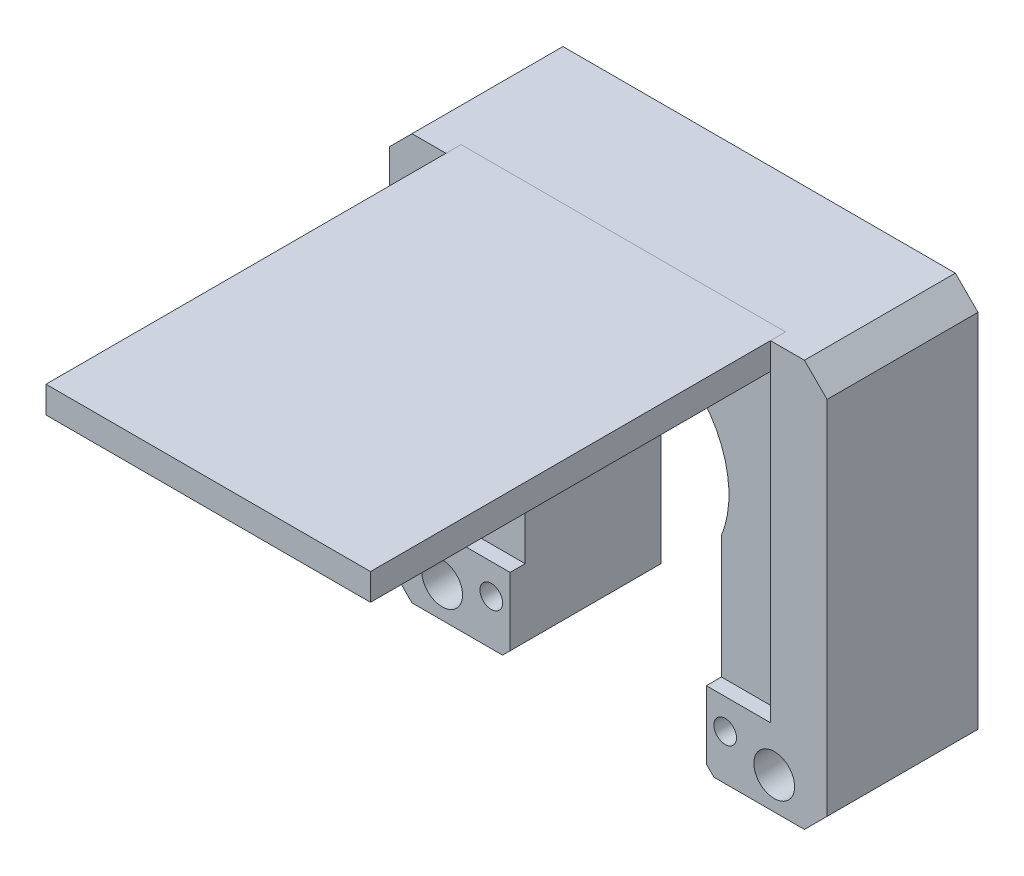
ISO-10303-21;
HEADER;
FILE_DESCRIPTION(('STEP AP214'),'2;1');
FILE_NAME('part.step','',(''),(''),'','','');
FILE_SCHEMA(('AUTOMOTIVE_DESIGN { 1 0 10303 214 1 1 1 1 }'));
ENDSEC;
DATA;
#1=APPLICATION_CONTEXT('core data for automotive mechanical design processes');
#2=APPLICATION_PROTOCOL_DEFINITION('international standard','automotive_design',2000,#1);
#3=PRODUCT_CONTEXT('',#1,'mechanical');
#4=PRODUCT('Part','Part','',(#3));
#5=PRODUCT_RELATED_PRODUCT_CATEGORY('part','',(#4));
#6=PRODUCT_DEFINITION_FORMATION('','',#4);
#7=PRODUCT_DEFINITION_CONTEXT('part definition',#1,'design');
#8=PRODUCT_DEFINITION('design','',#6,#7);
#9=PRODUCT_DEFINITION_SHAPE('','',#8);
#10=(LENGTH_UNIT() NAMED_UNIT(*) SI_UNIT(.MILLI.,.METRE.));
#11=(NAMED_UNIT(*) PLANE_ANGLE_UNIT() SI_UNIT($,.RADIAN.));
#12=(NAMED_UNIT(*) SI_UNIT($,.STERADIAN.) SOLID_ANGLE_UNIT());
#13=UNCERTAINTY_MEASURE_WITH_UNIT(LENGTH_MEASURE(1.E-05),#10,'distance_accuracy_value','');
#14=(GEOMETRIC_REPRESENTATION_CONTEXT(3) GLOBAL_UNCERTAINTY_ASSIGNED_CONTEXT((#13)) GLOBAL_UNIT_ASSIGNED_CONTEXT((#10,
#11,#12)) REPRESENTATION_CONTEXT('',''));
#15=CARTESIAN_POINT('',(0.,0.,0.));
#16=DIRECTION('',(0.,0.,1.));
#17=DIRECTION('',(1.,0.,0.));
#18=AXIS2_PLACEMENT_3D('',#15,#16,#17);
#19=CARTESIAN_POINT('',(-21.5,10.,73.));
#20=DIRECTION('',(1.,0.,0.));
#21=DIRECTION('',(0.,0.,-1.));
#22=AXIS2_PLACEMENT_3D('',#19,#20,#21);
#23=PLANE('',#22);
#24=DIRECTION('',(0.,-1.,0.));
#25=VECTOR('',#24,1.);
#26=CARTESIAN_POINT('',(-21.5,10.,18.));
#27=LINE('',#26,#25);
#28=CARTESIAN_POINT('',(-21.5,10.,18.));
#29=VERTEX_POINT('',#28);
#30=CARTESIAN_POINT('',(-21.5,6.46596793747799,18.));
#31=VERTEX_POINT('',#30);
#32=EDGE_CURVE('E114',#29,#31,#27,.T.);
#33=ORIENTED_EDGE('',*,*,#32,.T.);
#34=DIRECTION('',(0.,0.,-1.));
#35=VECTOR('',#34,1.);
#36=CARTESIAN_POINT('',(-21.5,6.46596793747799,73.));
#37=LINE('',#36,#35);
#38=CARTESIAN_POINT('',(-21.5,6.46596793747799,73.));
#39=VERTEX_POINT('',#38);
#40=EDGE_CURVE('E12',#39,#31,#37,.T.);
#41=ORIENTED_EDGE('',*,*,#40,.F.);
#42=DIRECTION('',(0.,-1.,0.));
#43=VECTOR('',#42,1.);
#44=CARTESIAN_POINT('',(-21.5,10.,73.));
#45=LINE('',#44,#43);
#46=CARTESIAN_POINT('',(-21.5,10.,73.));
#47=VERTEX_POINT('',#46);
#48=EDGE_CURVE('E102',#47,#39,#45,.T.);
#49=ORIENTED_EDGE('',*,*,#48,.F.);
#50=DIRECTION('',(0.,0.,-1.));
#51=VECTOR('',#50,1.);
#52=CARTESIAN_POINT('',(-21.5,10.,73.));
#53=LINE('',#52,#51);
#54=EDGE_CURVE('E110',#47,#29,#53,.T.);
#55=ORIENTED_EDGE('',*,*,#54,.T.);
#56=EDGE_LOOP('',(#33,#41,#49,#55));
#57=FACE_BOUND('',#56,.T.);
#58=ADVANCED_FACE('F51',(#57),#23,.F.);
#59=CARTESIAN_POINT('',(-21.5,6.46596793747799,73.));
#60=DIRECTION('',(0.,1.,0.));
#61=DIRECTION('',(0.,0.,1.));
#62=AXIS2_PLACEMENT_3D('',#59,#60,#61);
#63=PLANE('',#62);
#64=DIRECTION('',(1.,0.,0.));
#65=VECTOR('',#64,1.);
#66=CARTESIAN_POINT('',(-21.5,6.46596793747799,18.));
#67=LINE('',#66,#65);
#68=CARTESIAN_POINT('',(21.5,6.46596793747799,18.));
#69=VERTEX_POINT('',#68);
#70=EDGE_CURVE('E106',#31,#69,#67,.T.);
#71=ORIENTED_EDGE('',*,*,#70,.T.);
#72=DIRECTION('',(0.,0.,-1.));
#73=VECTOR('',#72,1.);
#74=CARTESIAN_POINT('',(21.5,6.46596793747799,73.));
#75=LINE('',#74,#73);
#76=CARTESIAN_POINT('',(21.5,6.46596793747799,73.));
#77=VERTEX_POINT('',#76);
#78=EDGE_CURVE('E59',#77,#69,#75,.T.);
#79=ORIENTED_EDGE('',*,*,#78,.F.);
#80=DIRECTION('',(1.,0.,0.));
#81=VECTOR('',#80,1.);
#82=CARTESIAN_POINT('',(-21.5,6.46596793747799,73.));
#83=LINE('',#82,#81);
#84=EDGE_CURVE('E97',#39,#77,#83,.T.);
#85=ORIENTED_EDGE('',*,*,#84,.F.);
#86=ORIENTED_EDGE('',*,*,#40,.T.);
#87=EDGE_LOOP('',(#71,#79,#85,#86));
#88=FACE_BOUND('',#87,.T.);
#89=ADVANCED_FACE('F105',(#88),#63,.F.);
#90=CARTESIAN_POINT('',(21.5,6.46596793747799,73.));
#91=DIRECTION('',(-1.,0.,0.));
#92=DIRECTION('',(0.,-1.,0.));
#93=AXIS2_PLACEMENT_3D('',#90,#91,#92);
#94=PLANE('',#93);
#95=DIRECTION('',(0.,1.,0.));
#96=VECTOR('',#95,1.);
#97=CARTESIAN_POINT('',(21.5,6.46596793747799,18.));
#98=LINE('',#97,#96);
#99=CARTESIAN_POINT('',(21.5,10.,18.));
#100=VERTEX_POINT('',#99);
#101=EDGE_CURVE('E84',#69,#100,#98,.T.);
#102=ORIENTED_EDGE('',*,*,#101,.T.);
#103=DIRECTION('',(0.,0.,-1.));
#104=VECTOR('',#103,1.);
#105=CARTESIAN_POINT('',(21.5,10.,73.));
#106=LINE('',#105,#104);
#107=CARTESIAN_POINT('',(21.5,10.,73.));
#108=VERTEX_POINT('',#107);
#109=EDGE_CURVE('E107',#108,#100,#106,.T.);
#110=ORIENTED_EDGE('',*,*,#109,.F.);
#111=DIRECTION('',(0.,1.,0.));
#112=VECTOR('',#111,1.);
#113=CARTESIAN_POINT('',(21.5,6.46596793747799,73.));
#114=LINE('',#113,#112);
#115=EDGE_CURVE('E100',#77,#108,#114,.T.);
#116=ORIENTED_EDGE('',*,*,#115,.F.);
#117=ORIENTED_EDGE('',*,*,#78,.T.);
#118=EDGE_LOOP('',(#102,#110,#116,#117));
#119=FACE_BOUND('',#118,.T.);
#120=ADVANCED_FACE('F108',(#119),#94,.F.);
#121=CARTESIAN_POINT('',(-21.5,10.,73.));
#122=DIRECTION('',(0.,-1.,0.));
#123=DIRECTION('',(1.,0.,0.));
#124=AXIS2_PLACEMENT_3D('',#121,#122,#123);
#125=PLANE('',#124);
#126=DIRECTION('',(-1.,0.,0.));
#127=VECTOR('',#126,1.);
#128=CARTESIAN_POINT('',(-21.5,10.,18.));
#129=LINE('',#128,#127);
#130=EDGE_CURVE('E90',#100,#29,#129,.T.);
#131=ORIENTED_EDGE('',*,*,#130,.T.);
#132=ORIENTED_EDGE('',*,*,#54,.F.);
#133=DIRECTION('',(-1.,0.,0.));
#134=VECTOR('',#133,1.);
#135=CARTESIAN_POINT('',(-21.5,10.,73.));
#136=LINE('',#135,#134);
#137=EDGE_CURVE('E67',#108,#47,#136,.T.);
#138=ORIENTED_EDGE('',*,*,#137,.F.);
#139=ORIENTED_EDGE('',*,*,#109,.T.);
#140=EDGE_LOOP('',(#131,#132,#138,#139));
#141=FACE_BOUND('',#140,.T.);
#142=ADVANCED_FACE('F121',(#141),#125,.F.);
#143=CARTESIAN_POINT('',(0.,0.,73.));
#144=DIRECTION('',(0.,0.,1.));
#145=DIRECTION('',(1.,0.,0.));
#146=AXIS2_PLACEMENT_3D('',#143,#144,#145);
#147=PLANE('',#146);
#148=ORIENTED_EDGE('',*,*,#48,.T.);
#149=ORIENTED_EDGE('',*,*,#84,.T.);
#150=ORIENTED_EDGE('',*,*,#115,.T.);
#151=ORIENTED_EDGE('',*,*,#137,.T.);
#152=EDGE_LOOP('',(#148,#149,#150,#151));
#153=FACE_BOUND('',#152,.T.);
#154=ADVANCED_FACE('F98',(#153),#147,.T.);
#155=CARTESIAN_POINT('',(0.,0.,18.));
#156=DIRECTION('',(0.,0.,1.));
#157=DIRECTION('',(1.,0.,0.));
#158=AXIS2_PLACEMENT_3D('',#155,#156,#157);
#159=PLANE('',#158);
#160=ORIENTED_EDGE('',*,*,#32,.F.);
#161=ORIENTED_EDGE('',*,*,#130,.F.);
#162=ORIENTED_EDGE('',*,*,#101,.F.);
#163=ORIENTED_EDGE('',*,*,#70,.F.);
#164=EDGE_LOOP('',(#160,#161,#162,#163));
#165=FACE_BOUND('',#164,.T.);
#166=ADVANCED_FACE('F124',(#165),#159,.F.);
#167=CLOSED_SHELL('',(#58,#89,#120,#142,#154,#166));
#168=MANIFOLD_SOLID_BREP('B2',#167);
#169=CARTESIAN_POINT('',(0.,0.,20.));
#170=DIRECTION('',(0.,0.,1.));
#171=DIRECTION('',(1.,0.,0.));
#172=AXIS2_PLACEMENT_3D('',#169,#170,#171);
#173=PLANE('',#172);
#174=CARTESIAN_POINT('',(15.5,-37.84770830376,20.));
#175=DIRECTION('',(0.,0.,1.));
#176=DIRECTION('',(-1.,0.,0.));
#177=AXIS2_PLACEMENT_3D('',#174,#175,#176);
#178=CIRCLE('',#177,1.5);
#179=CARTESIAN_POINT('',(14.,-37.84770830376,20.));
#180=VERTEX_POINT('',#179);
#181=EDGE_CURVE('E673',#180,#180,#178,.T.);
#182=ORIENTED_EDGE('',*,*,#181,.F.);
#183=EDGE_LOOP('',(#182));
#184=FACE_BOUND('',#183,.T.);
#185=DIRECTION('',(0.,1.,0.));
#186=VECTOR('',#185,1.);
#187=CARTESIAN_POINT('',(13.,-69.9992877658143,20.));
#188=LINE('',#187,#186);
#189=CARTESIAN_POINT('',(13.,-42.84770830376,20.));
#190=VERTEX_POINT('',#189);
#191=CARTESIAN_POINT('',(13.,-33.84770830376,20.));
#192=VERTEX_POINT('',#191);
#193=EDGE_CURVE('E354',#190,#192,#188,.T.);
#194=ORIENTED_EDGE('',*,*,#193,.F.);
#195=DIRECTION('',(-0.707106781186551,0.707106781186544,0.));
#196=VECTOR('',#195,1.);
#197=CARTESIAN_POINT('',(-14.9238541518801,-14.9238541518802,20.));
#198=LINE('',#197,#196);
#199=CARTESIAN_POINT('',(14.,-43.84770830376,20.));
#200=VERTEX_POINT('',#199);
#201=EDGE_CURVE('E185',#190,#200,#198,.F.);
#202=ORIENTED_EDGE('',*,*,#201,.T.);
#203=DIRECTION('',(1.,0.,0.));
#204=VECTOR('',#203,1.);
#205=CARTESIAN_POINT('',(-29.,-43.84770830376,20.));
#206=LINE('',#205,#204);
#207=CARTESIAN_POINT('',(26.,-43.84770830376,20.));
#208=VERTEX_POINT('',#207);
#209=EDGE_CURVE('E457',#200,#208,#206,.T.);
#210=ORIENTED_EDGE('',*,*,#209,.T.);
#211=DIRECTION('',(-0.707106781186549,-0.707106781186546,0.));
#212=VECTOR('',#211,1.);
#213=CARTESIAN_POINT('',(34.92385415188,-34.9238541518801,20.));
#214=LINE('',#213,#212);
#215=CARTESIAN_POINT('',(29.,-40.8477083037601,20.));
#216=VERTEX_POINT('',#215);
#217=EDGE_CURVE('E543',#208,#216,#214,.F.);
#218=ORIENTED_EDGE('',*,*,#217,.T.);
#219=DIRECTION('',(0.,1.,0.));
#220=VECTOR('',#219,1.);
#221=CARTESIAN_POINT('',(29.,0.,20.));
#222=LINE('',#221,#220);
#223=CARTESIAN_POINT('',(29.,7.00000000000001,20.));
#224=VERTEX_POINT('',#223);
#225=EDGE_CURVE('E463',#216,#224,#222,.T.);
#226=ORIENTED_EDGE('',*,*,#225,.T.);
#227=DIRECTION('',(0.707106781186546,-0.707106781186549,0.));
#228=VECTOR('',#227,1.);
#229=CARTESIAN_POINT('',(18.0000000000001,18.,20.));
#230=LINE('',#229,#228);
#231=CARTESIAN_POINT('',(26.,10.,20.));
#232=VERTEX_POINT('',#231);
#233=EDGE_CURVE('E540',#224,#232,#230,.F.);
#234=ORIENTED_EDGE('',*,*,#233,.T.);
#235=DIRECTION('',(-1.,0.,0.));
#236=VECTOR('',#235,1.);
#237=CARTESIAN_POINT('',(29.,10.,20.));
#238=LINE('',#237,#236);
#239=CARTESIAN_POINT('',(21.5,10.,20.));
#240=VERTEX_POINT('',#239);
#241=EDGE_CURVE('E468',#232,#240,#238,.T.);
#242=ORIENTED_EDGE('',*,*,#241,.T.);
#243=DIRECTION('',(0.,1.,0.));
#244=VECTOR('',#243,1.);
#245=CARTESIAN_POINT('',(21.5,10.,20.));
#246=LINE('',#245,#244);
#247=CARTESIAN_POINT('',(21.5,-33.84770830376,20.));
#248=VERTEX_POINT('',#247);
#249=EDGE_CURVE('E385',#248,#240,#246,.T.);
#250=ORIENTED_EDGE('',*,*,#249,.F.);
#251=DIRECTION('',(1.,0.,0.));
#252=VECTOR('',#251,1.);
#253=CARTESIAN_POINT('',(-21.5,-33.84770830376,20.));
#254=LINE('',#253,#252);
#255=EDGE_CURVE('E396',#192,#248,#254,.T.);
#256=ORIENTED_EDGE('',*,*,#255,.F.);
#257=EDGE_LOOP('',(#194,#202,#210,#218,#226,#234,#242,#250,#256));
#258=FACE_BOUND('',#257,.T.);
#259=CARTESIAN_POINT('',(22.,-39.59770830376,20.));
#260=DIRECTION('',(0.,0.,1.));
#261=DIRECTION('',(1.,0.,0.));
#262=AXIS2_PLACEMENT_3D('',#259,#260,#261);
#263=CIRCLE('',#262,2.7);
#264=CARTESIAN_POINT('',(24.7,-39.59770830376,20.));
#265=VERTEX_POINT('',#264);
#266=EDGE_CURVE('E441',#265,#265,#263,.F.);
#267=ORIENTED_EDGE('',*,*,#266,.T.);
#268=EDGE_LOOP('',(#267));
#269=FACE_BOUND('',#268,.T.);
#270=ADVANCED_FACE('F175',(#184,#258,#269),#173,.T.);
#271=CARTESIAN_POINT('',(-29.,-43.84770830376,20.));
#272=DIRECTION('',(0.,1.,0.));
#273=DIRECTION('',(-1.,0.,0.));
#274=AXIS2_PLACEMENT_3D('',#271,#272,#273);
#275=PLANE('',#274);
#276=ORIENTED_EDGE('',*,*,#209,.F.);
#277=DIRECTION('',(0.,0.,-1.));
#278=VECTOR('',#277,1.);
#279=CARTESIAN_POINT('',(14.,-43.84770830376,20.));
#280=LINE('',#279,#278);
#281=CARTESIAN_POINT('',(14.,-43.84770830376,0.));
#282=VERTEX_POINT('',#281);
#283=EDGE_CURVE('E49',#200,#282,#280,.T.);
#284=ORIENTED_EDGE('',*,*,#283,.T.);
#285=DIRECTION('',(1.,0.,0.));
#286=VECTOR('',#285,1.);
#287=CARTESIAN_POINT('',(-29.,-43.84770830376,0.));
#288=LINE('',#287,#286);
#289=CARTESIAN_POINT('',(21.3461651584688,-43.84770830376,0.));
#290=VERTEX_POINT('',#289);
#291=EDGE_CURVE('E478',#282,#290,#288,.T.);
#292=ORIENTED_EDGE('',*,*,#291,.T.);
#293=DIRECTION('',(0.,0.,-1.));
#294=VECTOR('',#293,1.);
#295=CARTESIAN_POINT('',(21.3461651584688,-43.84770830376,3.));
#296=LINE('',#295,#294);
#297=CARTESIAN_POINT('',(21.3461651584688,-43.84770830376,3.));
#298=VERTEX_POINT('',#297);
#299=EDGE_CURVE('E502',#290,#298,#296,.F.);
#300=ORIENTED_EDGE('',*,*,#299,.T.);
#301=DIRECTION('',(-1.,0.,0.));
#302=VECTOR('',#301,1.);
#303=CARTESIAN_POINT('',(-29.,-43.84770830376,3.));
#304=LINE('',#303,#302);
#305=CARTESIAN_POINT('',(22.6538348415312,-43.84770830376,3.));
#306=VERTEX_POINT('',#305);
#307=EDGE_CURVE('E433',#306,#298,#304,.T.);
#308=ORIENTED_EDGE('',*,*,#307,.F.);
#309=DIRECTION('',(0.,0.,-1.));
#310=VECTOR('',#309,1.);
#311=CARTESIAN_POINT('',(22.6538348415312,-43.84770830376,3.));
#312=LINE('',#311,#310);
#313=CARTESIAN_POINT('',(22.6538348415312,-43.84770830376,0.));
#314=VERTEX_POINT('',#313);
#315=EDGE_CURVE('E506',#306,#314,#312,.T.);
#316=ORIENTED_EDGE('',*,*,#315,.T.);
#317=CARTESIAN_POINT('',(26.,-43.84770830376,0.));
#318=VERTEX_POINT('',#317);
#319=EDGE_CURVE('E452',#314,#318,#288,.T.);
#320=ORIENTED_EDGE('',*,*,#319,.T.);
#321=DIRECTION('',(0.,0.,1.));
#322=VECTOR('',#321,1.);
#323=CARTESIAN_POINT('',(26.,-43.84770830376,20.));
#324=LINE('',#323,#322);
#325=EDGE_CURVE('E510',#318,#208,#324,.T.);
#326=ORIENTED_EDGE('',*,*,#325,.T.);
#327=EDGE_LOOP('',(#276,#284,#292,#300,#308,#316,#320,#326));
#328=FACE_BOUND('',#327,.T.);
#329=ADVANCED_FACE('F595',(#328),#275,.F.);
#330=CARTESIAN_POINT('',(-21.5,-33.84770830376,18.));
#331=DIRECTION('',(0.,-1.,0.));
#332=DIRECTION('',(0.,0.,-1.));
#333=AXIS2_PLACEMENT_3D('',#330,#331,#332);
#334=PLANE('',#333);
#335=DIRECTION('',(1.,0.,0.));
#336=VECTOR('',#335,1.);
#337=CARTESIAN_POINT('',(-21.5,-33.84770830376,18.));
#338=LINE('',#337,#336);
#339=CARTESIAN_POINT('',(13.,-33.84770830376,18.));
#340=VERTEX_POINT('',#339);
#341=CARTESIAN_POINT('',(21.5,-33.84770830376,18.));
#342=VERTEX_POINT('',#341);
#343=EDGE_CURVE('E365',#340,#342,#338,.T.);
#344=ORIENTED_EDGE('',*,*,#343,.F.);
#345=DIRECTION('',(0.,0.,-1.));
#346=VECTOR('',#345,1.);
#347=CARTESIAN_POINT('',(13.,-33.84770830376,-0.001000000000001));
#348=LINE('',#347,#346);
#349=EDGE_CURVE('E347',#192,#340,#348,.T.);
#350=ORIENTED_EDGE('',*,*,#349,.F.);
#351=ORIENTED_EDGE('',*,*,#255,.T.);
#352=DIRECTION('',(0.,0.,1.));
#353=VECTOR('',#352,1.);
#354=CARTESIAN_POINT('',(21.5,-33.84770830376,18.));
#355=LINE('',#354,#353);
#356=EDGE_CURVE('E374',#342,#248,#355,.T.);
#357=ORIENTED_EDGE('',*,*,#356,.F.);
#358=EDGE_LOOP('',(#344,#350,#351,#357));
#359=FACE_BOUND('',#358,.T.);
#360=ADVANCED_FACE('F372',(#359),#334,.F.);
#361=CARTESIAN_POINT('',(-22.,-39.59770830376,20.001));
#362=DIRECTION('',(0.,0.,-1.));
#363=DIRECTION('',(-1.,0.,0.));
#364=AXIS2_PLACEMENT_3D('',#361,#362,#363);
#365=CYLINDRICAL_SURFACE('',#364,2.7);
#366=CARTESIAN_POINT('',(-22.,-39.59770830376,20.));
#367=DIRECTION('',(0.,0.,1.));
#368=DIRECTION('',(1.,0.,0.));
#369=AXIS2_PLACEMENT_3D('',#366,#367,#368);
#370=CIRCLE('',#369,2.7);
#371=CARTESIAN_POINT('',(-19.3,-39.59770830376,20.));
#372=VERTEX_POINT('',#371);
#373=EDGE_CURVE('E440',#372,#372,#370,.F.);
#374=ORIENTED_EDGE('',*,*,#373,.F.);
#375=EDGE_LOOP('',(#374));
#376=FACE_BOUND('',#375,.T.);
#377=CARTESIAN_POINT('',(-22.,-39.59770830376,3.));
#378=DIRECTION('',(0.,0.,-1.));
#379=DIRECTION('',(-1.,0.,0.));
#380=AXIS2_PLACEMENT_3D('',#377,#378,#379);
#381=CIRCLE('',#380,2.7);
#382=CARTESIAN_POINT('',(-24.7,-39.59770830376,3.));
#383=VERTEX_POINT('',#382);
#384=EDGE_CURVE('E436',#383,#383,#381,.F.);
#385=ORIENTED_EDGE('',*,*,#384,.F.);
#386=EDGE_LOOP('',(#385));
#387=FACE_BOUND('',#386,.T.);
#388=ADVANCED_FACE('F700',(#376,#387),#365,.F.);
#389=CARTESIAN_POINT('',(22.,-39.59770830376,20.001));
#390=DIRECTION('',(0.,0.,-1.));
#391=DIRECTION('',(-1.,0.,0.));
#392=AXIS2_PLACEMENT_3D('',#389,#390,#391);
#393=CYLINDRICAL_SURFACE('',#392,2.7);
#394=ORIENTED_EDGE('',*,*,#266,.F.);
#395=EDGE_LOOP('',(#394));
#396=FACE_BOUND('',#395,.T.);
#397=CARTESIAN_POINT('',(22.,-39.59770830376,3.));
#398=DIRECTION('',(0.,0.,-1.));
#399=DIRECTION('',(-1.,0.,0.));
#400=AXIS2_PLACEMENT_3D('',#397,#398,#399);
#401=CIRCLE('',#400,2.7);
#402=CARTESIAN_POINT('',(19.3,-39.59770830376,3.));
#403=VERTEX_POINT('',#402);
#404=EDGE_CURVE('E424',#403,#403,#401,.F.);
#405=ORIENTED_EDGE('',*,*,#404,.F.);
#406=EDGE_LOOP('',(#405));
#407=FACE_BOUND('',#406,.T.);
#408=ADVANCED_FACE('F693',(#396,#407),#393,.F.);
#409=CARTESIAN_POINT('',(-15.5,-37.84770830376,20.));
#410=DIRECTION('',(0.,0.,1.));
#411=DIRECTION('',(1.,0.,0.));
#412=AXIS2_PLACEMENT_3D('',#409,#410,#411);
#413=CIRCLE('',#412,1.5);
#414=CARTESIAN_POINT('',(-14.,-37.84770830376,20.));
#415=VERTEX_POINT('',#414);
#416=EDGE_CURVE('E665',#415,#415,#413,.T.);
#417=ORIENTED_EDGE('',*,*,#416,.F.);
#418=EDGE_LOOP('',(#417));
#419=FACE_BOUND('',#418,.T.);
#420=CARTESIAN_POINT('',(-26.,-43.84770830376,20.));
#421=VERTEX_POINT('',#420);
#422=CARTESIAN_POINT('',(-14.,-43.84770830376,20.));
#423=VERTEX_POINT('',#422);
#424=EDGE_CURVE('E459',#421,#423,#206,.T.);
#425=ORIENTED_EDGE('',*,*,#424,.T.);
#426=DIRECTION('',(-0.707106781186543,-0.707106781186552,0.));
#427=VECTOR('',#426,1.);
#428=CARTESIAN_POINT('',(14.9238541518799,-14.9238541518797,20.));
#429=LINE('',#428,#427);
#430=CARTESIAN_POINT('',(-13.,-42.84770830376,20.));
#431=VERTEX_POINT('',#430);
#432=EDGE_CURVE('E579',#423,#431,#429,.F.);
#433=ORIENTED_EDGE('',*,*,#432,.T.);
#434=DIRECTION('',(0.,-1.,0.));
#435=VECTOR('',#434,1.);
#436=CARTESIAN_POINT('',(-13.,-69.9992877658143,20.));
#437=LINE('',#436,#435);
#438=CARTESIAN_POINT('',(-13.,-33.84770830376,20.));
#439=VERTEX_POINT('',#438);
#440=EDGE_CURVE('E646',#439,#431,#437,.T.);
#441=ORIENTED_EDGE('',*,*,#440,.F.);
#442=CARTESIAN_POINT('',(-21.5,-33.84770830376,20.));
#443=VERTEX_POINT('',#442);
#444=EDGE_CURVE('E398',#443,#439,#254,.T.);
#445=ORIENTED_EDGE('',*,*,#444,.F.);
#446=DIRECTION('',(0.,-1.,0.));
#447=VECTOR('',#446,1.);
#448=CARTESIAN_POINT('',(-21.5,10.,20.));
#449=LINE('',#448,#447);
#450=CARTESIAN_POINT('',(-21.5,10.,20.));
#451=VERTEX_POINT('',#450);
#452=EDGE_CURVE('E392',#451,#443,#449,.T.);
#453=ORIENTED_EDGE('',*,*,#452,.F.);
#454=CARTESIAN_POINT('',(-26.,10.,20.));
#455=VERTEX_POINT('',#454);
#456=EDGE_CURVE('E467',#451,#455,#238,.T.);
#457=ORIENTED_EDGE('',*,*,#456,.T.);
#458=DIRECTION('',(0.707106781186549,0.707106781186546,0.));
#459=VECTOR('',#458,1.);
#460=CARTESIAN_POINT('',(-17.9999999999999,18.,20.));
#461=LINE('',#460,#459);
#462=CARTESIAN_POINT('',(-29.,7.00000000000002,20.));
#463=VERTEX_POINT('',#462);
#464=EDGE_CURVE('E537',#455,#463,#461,.F.);
#465=ORIENTED_EDGE('',*,*,#464,.T.);
#466=DIRECTION('',(0.,-1.,0.));
#467=VECTOR('',#466,1.);
#468=CARTESIAN_POINT('',(-29.,0.,20.));
#469=LINE('',#468,#467);
#470=CARTESIAN_POINT('',(-29.,-40.8477083037601,20.));
#471=VERTEX_POINT('',#470);
#472=EDGE_CURVE('E453',#463,#471,#469,.T.);
#473=ORIENTED_EDGE('',*,*,#472,.T.);
#474=DIRECTION('',(-0.707106781186547,0.707106781186548,0.));
#475=VECTOR('',#474,1.);
#476=CARTESIAN_POINT('',(-34.9238541518801,-34.92385415188,20.));
#477=LINE('',#476,#475);
#478=EDGE_CURVE('E546',#471,#421,#477,.F.);
#479=ORIENTED_EDGE('',*,*,#478,.T.);
#480=EDGE_LOOP('',(#425,#433,#441,#445,#453,#457,#465,#473,#479));
#481=FACE_BOUND('',#480,.T.);
#482=ORIENTED_EDGE('',*,*,#373,.T.);
#483=EDGE_LOOP('',(#482));
#484=FACE_BOUND('',#483,.T.);
#485=ADVANCED_FACE('F683',(#419,#481,#484),#173,.T.);
#486=CARTESIAN_POINT('',(0.,0.,0.));
#487=DIRECTION('',(0.,0.,1.));
#488=DIRECTION('',(1.,0.,0.));
#489=AXIS2_PLACEMENT_3D('',#486,#487,#488);
#490=PLANE('',#489);
#491=CARTESIAN_POINT('',(-15.5,-37.84770830376,0.));
#492=DIRECTION('',(0.,0.,1.));
#493=DIRECTION('',(1.,0.,0.));
#494=AXIS2_PLACEMENT_3D('',#491,#492,#493);
#495=CIRCLE('',#494,1.5);
#496=CARTESIAN_POINT('',(-14.,-37.84770830376,0.));
#497=VERTEX_POINT('',#496);
#498=EDGE_CURVE('E661',#497,#497,#495,.T.);
#499=ORIENTED_EDGE('',*,*,#498,.T.);
#500=EDGE_LOOP('',(#499));
#501=FACE_BOUND('',#500,.T.);
#502=CARTESIAN_POINT('',(15.5,-37.84770830376,0.));
#503=DIRECTION('',(0.,0.,1.));
#504=DIRECTION('',(-1.,0.,0.));
#505=AXIS2_PLACEMENT_3D('',#502,#503,#504);
#506=CIRCLE('',#505,1.5);
#507=CARTESIAN_POINT('',(14.,-37.84770830376,0.));
#508=VERTEX_POINT('',#507);
#509=EDGE_CURVE('E669',#508,#508,#506,.T.);
#510=ORIENTED_EDGE('',*,*,#509,.T.);
#511=EDGE_LOOP('',(#510));
#512=FACE_BOUND('',#511,.T.);
#513=DIRECTION('',(0.,1.,0.));
#514=VECTOR('',#513,1.);
#515=CARTESIAN_POINT('',(-13.,-69.9992877658143,0.));
#516=LINE('',#515,#514);
#517=CARTESIAN_POINT('',(-13.,-42.84770830376,0.));
#518=VERTEX_POINT('',#517);
#519=CARTESIAN_POINT('',(-13.,-17.6961288417057,0.));
#520=VERTEX_POINT('',#519);
#521=EDGE_CURVE('E652',#518,#520,#516,.T.);
#522=ORIENTED_EDGE('',*,*,#521,.F.);
#523=DIRECTION('',(0.707106781186543,0.707106781186552,0.));
#524=VECTOR('',#523,1.);
#525=CARTESIAN_POINT('',(-13.,-42.84770830376,0.));
#526=LINE('',#525,#524);
#527=CARTESIAN_POINT('',(-14.,-43.84770830376,0.));
#528=VERTEX_POINT('',#527);
#529=EDGE_CURVE('E573',#518,#528,#526,.F.);
#530=ORIENTED_EDGE('',*,*,#529,.T.);
#531=CARTESIAN_POINT('',(-21.3461651584689,-43.84770830376,0.));
#532=VERTEX_POINT('',#531);
#533=EDGE_CURVE('E477',#532,#528,#288,.T.);
#534=ORIENTED_EDGE('',*,*,#533,.F.);
#535=CARTESIAN_POINT('',(-22.,-39.59770830376,0.));
#536=DIRECTION('',(0.,0.,-1.));
#537=DIRECTION('',(-1.,0.,0.));
#538=AXIS2_PLACEMENT_3D('',#535,#536,#537);
#539=CIRCLE('',#538,4.3);
#540=CARTESIAN_POINT('',(-22.6538348415311,-43.84770830376,0.));
#541=VERTEX_POINT('',#540);
#542=EDGE_CURVE('E420',#541,#532,#539,.T.);
#543=ORIENTED_EDGE('',*,*,#542,.F.);
#544=CARTESIAN_POINT('',(-26.,-43.84770830376,0.));
#545=VERTEX_POINT('',#544);
#546=EDGE_CURVE('E473',#545,#541,#288,.T.);
#547=ORIENTED_EDGE('',*,*,#546,.F.);
#548=DIRECTION('',(0.707106781186547,-0.707106781186548,0.));
#549=VECTOR('',#548,1.);
#550=CARTESIAN_POINT('',(-26.,-43.84770830376,0.));
#551=LINE('',#550,#549);
#552=CARTESIAN_POINT('',(-29.,-40.8477083037601,0.));
#553=VERTEX_POINT('',#552);
#554=EDGE_CURVE('E527',#545,#553,#551,.F.);
#555=ORIENTED_EDGE('',*,*,#554,.T.);
#556=DIRECTION('',(0.,-1.,0.));
#557=VECTOR('',#556,1.);
#558=CARTESIAN_POINT('',(-29.,10.,0.));
#559=LINE('',#558,#557);
#560=CARTESIAN_POINT('',(-29.,7.00000000000002,0.));
#561=VERTEX_POINT('',#560);
#562=EDGE_CURVE('E458',#561,#553,#559,.T.);
#563=ORIENTED_EDGE('',*,*,#562,.F.);
#564=DIRECTION('',(-0.707106781186549,-0.707106781186546,0.));
#565=VECTOR('',#564,1.);
#566=CARTESIAN_POINT('',(-29.,7.00000000000002,0.));
#567=LINE('',#566,#565);
#568=CARTESIAN_POINT('',(-26.,10.,0.));
#569=VERTEX_POINT('',#568);
#570=EDGE_CURVE('E518',#561,#569,#567,.F.);
#571=ORIENTED_EDGE('',*,*,#570,.T.);
#572=DIRECTION('',(-1.,0.,0.));
#573=VECTOR('',#572,1.);
#574=CARTESIAN_POINT('',(29.,10.,0.));
#575=LINE('',#574,#573);
#576=CARTESIAN_POINT('',(26.,10.,0.));
#577=VERTEX_POINT('',#576);
#578=EDGE_CURVE('E482',#577,#569,#575,.T.);
#579=ORIENTED_EDGE('',*,*,#578,.F.);
#580=DIRECTION('',(-0.707106781186546,0.707106781186549,0.));
#581=VECTOR('',#580,1.);
#582=CARTESIAN_POINT('',(26.,10.,0.));
#583=LINE('',#582,#581);
#584=CARTESIAN_POINT('',(29.,7.00000000000001,0.));
#585=VERTEX_POINT('',#584);
#586=EDGE_CURVE('E521',#577,#585,#583,.F.);
#587=ORIENTED_EDGE('',*,*,#586,.T.);
#588=DIRECTION('',(0.,1.,0.));
#589=VECTOR('',#588,1.);
#590=CARTESIAN_POINT('',(29.,10.,0.));
#591=LINE('',#590,#589);
#592=CARTESIAN_POINT('',(29.,-40.8477083037601,0.));
#593=VERTEX_POINT('',#592);
#594=EDGE_CURVE('E476',#593,#585,#591,.T.);
#595=ORIENTED_EDGE('',*,*,#594,.F.);
#596=DIRECTION('',(0.707106781186549,0.707106781186546,0.));
#597=VECTOR('',#596,1.);
#598=CARTESIAN_POINT('',(29.,-40.8477083037601,0.));
#599=LINE('',#598,#597);
#600=EDGE_CURVE('E524',#593,#318,#599,.F.);
#601=ORIENTED_EDGE('',*,*,#600,.T.);
#602=ORIENTED_EDGE('',*,*,#319,.F.);
#603=CARTESIAN_POINT('',(22.,-39.59770830376,0.));
#604=DIRECTION('',(0.,0.,-1.));
#605=DIRECTION('',(-1.,0.,0.));
#606=AXIS2_PLACEMENT_3D('',#603,#604,#605);
#607=CIRCLE('',#606,4.3);
#608=EDGE_CURVE('E425',#290,#314,#607,.T.);
#609=ORIENTED_EDGE('',*,*,#608,.F.);
#610=ORIENTED_EDGE('',*,*,#291,.F.);
#611=DIRECTION('',(0.707106781186551,-0.707106781186544,0.));
#612=VECTOR('',#611,1.);
#613=CARTESIAN_POINT('',(13.,-42.84770830376,0.));
#614=LINE('',#613,#612);
#615=CARTESIAN_POINT('',(13.,-42.84770830376,0.));
#616=VERTEX_POINT('',#615);
#617=EDGE_CURVE('E570',#282,#616,#614,.F.);
#618=ORIENTED_EDGE('',*,*,#617,.T.);
#619=DIRECTION('',(0.,-1.,0.));
#620=VECTOR('',#619,1.);
#621=CARTESIAN_POINT('',(13.,-69.9992877658143,0.));
#622=LINE('',#621,#620);
#623=CARTESIAN_POINT('',(13.,-17.6961288417057,0.));
#624=VERTEX_POINT('',#623);
#625=EDGE_CURVE('E370',#624,#616,#622,.T.);
#626=ORIENTED_EDGE('',*,*,#625,.F.);
#627=DIRECTION('',(1.,0.,0.));
#628=VECTOR('',#627,1.);
#629=CARTESIAN_POINT('',(-13.,-17.6961288417057,0.));
#630=LINE('',#629,#628);
#631=CARTESIAN_POINT('',(12.9716987016704,-17.6961288417057,0.));
#632=VERTEX_POINT('',#631);
#633=EDGE_CURVE('E397',#632,#624,#630,.T.);
#634=ORIENTED_EDGE('',*,*,#633,.F.);
#635=CARTESIAN_POINT('',(0.,-12.4297227812995,0.));
#636=DIRECTION('',(0.,0.,1.));
#637=DIRECTION('',(1.,0.,0.));
#638=AXIS2_PLACEMENT_3D('',#635,#636,#637);
#639=CIRCLE('',#638,14.);
#640=CARTESIAN_POINT('',(-12.9716987016704,-17.6961288417057,0.));
#641=VERTEX_POINT('',#640);
#642=EDGE_CURVE('E445',#632,#641,#639,.T.);
#643=ORIENTED_EDGE('',*,*,#642,.T.);
#644=EDGE_CURVE('E628',#520,#641,#630,.T.);
#645=ORIENTED_EDGE('',*,*,#644,.F.);
#646=EDGE_LOOP('',(#522,#530,#534,#543,#547,#555,#563,#571,#579,#587,#595,#601,#602,#609,#610,
#618,#626,#634,#643,#645));
#647=FACE_BOUND('',#646,.T.);
#648=ADVANCED_FACE('F692',(#501,#512,#647),#490,.F.);
#649=ORIENTED_EDGE('',*,*,#533,.T.);
#650=DIRECTION('',(0.,0.,1.));
#651=VECTOR('',#650,1.);
#652=CARTESIAN_POINT('',(-14.,-43.84770830376,20.));
#653=LINE('',#652,#651);
#654=EDGE_CURVE('E576',#528,#423,#653,.T.);
#655=ORIENTED_EDGE('',*,*,#654,.T.);
#656=ORIENTED_EDGE('',*,*,#424,.F.);
#657=DIRECTION('',(0.,0.,-1.));
#658=VECTOR('',#657,1.);
#659=CARTESIAN_POINT('',(-26.,-43.84770830376,20.));
#660=LINE('',#659,#658);
#661=EDGE_CURVE('E514',#421,#545,#660,.T.);
#662=ORIENTED_EDGE('',*,*,#661,.T.);
#663=ORIENTED_EDGE('',*,*,#546,.T.);
#664=DIRECTION('',(0.,0.,-1.));
#665=VECTOR('',#664,1.);
#666=CARTESIAN_POINT('',(-22.6538348415311,-43.84770830376,3.));
#667=LINE('',#666,#665);
#668=CARTESIAN_POINT('',(-22.6538348415311,-43.84770830376,3.));
#669=VERTEX_POINT('',#668);
#670=EDGE_CURVE('E472',#541,#669,#667,.F.);
#671=ORIENTED_EDGE('',*,*,#670,.T.);
#672=DIRECTION('',(-1.,0.,0.));
#673=VECTOR('',#672,1.);
#674=CARTESIAN_POINT('',(-29.,-43.84770830376,3.));
#675=LINE('',#674,#673);
#676=CARTESIAN_POINT('',(-21.3461651584689,-43.84770830376,3.));
#677=VERTEX_POINT('',#676);
#678=EDGE_CURVE('E437',#677,#669,#675,.T.);
#679=ORIENTED_EDGE('',*,*,#678,.F.);
#680=DIRECTION('',(0.,0.,-1.));
#681=VECTOR('',#680,1.);
#682=CARTESIAN_POINT('',(-21.3461651584689,-43.84770830376,3.));
#683=LINE('',#682,#681);
#684=EDGE_CURVE('E498',#677,#532,#683,.T.);
#685=ORIENTED_EDGE('',*,*,#684,.T.);
#686=EDGE_LOOP('',(#649,#655,#656,#662,#663,#671,#679,#685));
#687=FACE_BOUND('',#686,.T.);
#688=ADVANCED_FACE('F688',(#687),#275,.F.);
#689=CARTESIAN_POINT('',(29.,10.,20.));
#690=DIRECTION('',(-1.,0.,0.));
#691=DIRECTION('',(0.,-1.,0.));
#692=AXIS2_PLACEMENT_3D('',#689,#690,#691);
#693=PLANE('',#692);
#694=ORIENTED_EDGE('',*,*,#225,.F.);
#695=DIRECTION('',(0.,0.,-1.));
#696=VECTOR('',#695,1.);
#697=CARTESIAN_POINT('',(29.,-40.8477083037601,20.));
#698=LINE('',#697,#696);
#699=EDGE_CURVE('E552',#216,#593,#698,.T.);
#700=ORIENTED_EDGE('',*,*,#699,.T.);
#701=ORIENTED_EDGE('',*,*,#594,.T.);
#702=DIRECTION('',(0.,0.,1.));
#703=VECTOR('',#702,1.);
#704=CARTESIAN_POINT('',(29.,7.00000000000001,20.));
#705=LINE('',#704,#703);
#706=EDGE_CURVE('E549',#585,#224,#705,.T.);
#707=ORIENTED_EDGE('',*,*,#706,.T.);
#708=EDGE_LOOP('',(#694,#700,#701,#707));
#709=FACE_BOUND('',#708,.T.);
#710=ADVANCED_FACE('F608',(#709),#693,.F.);
#711=CARTESIAN_POINT('',(29.,10.,20.));
#712=DIRECTION('',(0.,-1.,0.));
#713=DIRECTION('',(1.,0.,0.));
#714=AXIS2_PLACEMENT_3D('',#711,#712,#713);
#715=PLANE('',#714);
#716=DIRECTION('',(1.,0.,0.));
#717=VECTOR('',#716,1.);
#718=CARTESIAN_POINT('',(29.,10.,18.));
#719=LINE('',#718,#717);
#720=CARTESIAN_POINT('',(-21.5,10.,18.));
#721=VERTEX_POINT('',#720);
#722=CARTESIAN_POINT('',(21.5,10.,18.));
#723=VERTEX_POINT('',#722);
#724=EDGE_CURVE('E416',#721,#723,#719,.T.);
#725=ORIENTED_EDGE('',*,*,#724,.T.);
#726=DIRECTION('',(0.,0.,1.));
#727=VECTOR('',#726,1.);
#728=CARTESIAN_POINT('',(21.5,10.,18.));
#729=LINE('',#728,#727);
#730=EDGE_CURVE('E404',#723,#240,#729,.T.);
#731=ORIENTED_EDGE('',*,*,#730,.T.);
#732=ORIENTED_EDGE('',*,*,#241,.F.);
#733=DIRECTION('',(0.,0.,-1.));
#734=VECTOR('',#733,1.);
#735=CARTESIAN_POINT('',(26.,10.,20.));
#736=LINE('',#735,#734);
#737=EDGE_CURVE('E560',#232,#577,#736,.T.);
#738=ORIENTED_EDGE('',*,*,#737,.T.);
#739=ORIENTED_EDGE('',*,*,#578,.T.);
#740=DIRECTION('',(0.,0.,1.));
#741=VECTOR('',#740,1.);
#742=CARTESIAN_POINT('',(-26.,10.,20.));
#743=LINE('',#742,#741);
#744=EDGE_CURVE('E556',#569,#455,#743,.T.);
#745=ORIENTED_EDGE('',*,*,#744,.T.);
#746=ORIENTED_EDGE('',*,*,#456,.F.);
#747=DIRECTION('',(0.,0.,1.));
#748=VECTOR('',#747,1.);
#749=CARTESIAN_POINT('',(-21.5,10.,18.));
#750=LINE('',#749,#748);
#751=EDGE_CURVE('E391',#721,#451,#750,.T.);
#752=ORIENTED_EDGE('',*,*,#751,.F.);
#753=EDGE_LOOP('',(#725,#731,#732,#738,#739,#745,#746,#752));
#754=FACE_BOUND('',#753,.T.);
#755=ADVANCED_FACE('F617',(#754),#715,.F.);
#756=CARTESIAN_POINT('',(-29.,10.,20.));
#757=DIRECTION('',(1.,0.,0.));
#758=DIRECTION('',(0.,1.,0.));
#759=AXIS2_PLACEMENT_3D('',#756,#757,#758);
#760=PLANE('',#759);
#761=ORIENTED_EDGE('',*,*,#562,.T.);
#762=DIRECTION('',(0.,0.,1.));
#763=VECTOR('',#762,1.);
#764=CARTESIAN_POINT('',(-29.,-40.8477083037601,20.));
#765=LINE('',#764,#763);
#766=EDGE_CURVE('E534',#553,#471,#765,.T.);
#767=ORIENTED_EDGE('',*,*,#766,.T.);
#768=ORIENTED_EDGE('',*,*,#472,.F.);
#769=DIRECTION('',(0.,0.,-1.));
#770=VECTOR('',#769,1.);
#771=CARTESIAN_POINT('',(-29.,7.00000000000002,20.));
#772=LINE('',#771,#770);
#773=EDGE_CURVE('E530',#463,#561,#772,.T.);
#774=ORIENTED_EDGE('',*,*,#773,.T.);
#775=EDGE_LOOP('',(#761,#767,#768,#774));
#776=FACE_BOUND('',#775,.T.);
#777=ADVANCED_FACE('F759',(#776),#760,.F.);
#778=CARTESIAN_POINT('',(0.,-12.4297227812995,20.));
#779=DIRECTION('',(0.,0.,-1.));
#780=DIRECTION('',(-1.,0.,0.));
#781=AXIS2_PLACEMENT_3D('',#778,#779,#780);
#782=CYLINDRICAL_SURFACE('',#781,14.);
#783=DIRECTION('',(0.,0.,-1.));
#784=VECTOR('',#783,1.);
#785=CARTESIAN_POINT('',(12.9716987016704,-17.6961288417057,20.));
#786=LINE('',#785,#784);
#787=CARTESIAN_POINT('',(12.9716987016704,-17.6961288417057,18.));
#788=VERTEX_POINT('',#787);
#789=EDGE_CURVE('E626',#632,#788,#786,.F.);
#790=ORIENTED_EDGE('',*,*,#789,.T.);
#791=CARTESIAN_POINT('',(0.,-12.4297227812995,18.));
#792=DIRECTION('',(0.,0.,-1.));
#793=DIRECTION('',(-1.,0.,0.));
#794=AXIS2_PLACEMENT_3D('',#791,#792,#793);
#795=CIRCLE('',#794,14.);
#796=CARTESIAN_POINT('',(-12.9716987016704,-17.6961288417057,18.));
#797=VERTEX_POINT('',#796);
#798=EDGE_CURVE('E408',#797,#788,#795,.T.);
#799=ORIENTED_EDGE('',*,*,#798,.F.);
#800=DIRECTION('',(0.,0.,-1.));
#801=VECTOR('',#800,1.);
#802=CARTESIAN_POINT('',(-12.9716987016704,-17.6961288417057,20.));
#803=LINE('',#802,#801);
#804=EDGE_CURVE('E635',#797,#641,#803,.T.);
#805=ORIENTED_EDGE('',*,*,#804,.T.);
#806=ORIENTED_EDGE('',*,*,#642,.F.);
#807=EDGE_LOOP('',(#790,#799,#805,#806));
#808=FACE_BOUND('',#807,.T.);
#809=ADVANCED_FACE('F813',(#808),#782,.F.);
#810=CARTESIAN_POINT('',(22.,-39.59770830376,3.));
#811=DIRECTION('',(0.,0.,-1.));
#812=DIRECTION('',(-1.,0.,0.));
#813=AXIS2_PLACEMENT_3D('',#810,#811,#812);
#814=CYLINDRICAL_SURFACE('',#813,4.3);
#815=CARTESIAN_POINT('',(22.,-39.59770830376,3.));
#816=DIRECTION('',(0.,0.,-1.));
#817=DIRECTION('',(-1.,0.,0.));
#818=AXIS2_PLACEMENT_3D('',#815,#816,#817);
#819=CIRCLE('',#818,4.3);
#820=EDGE_CURVE('E421',#298,#306,#819,.T.);
#821=ORIENTED_EDGE('',*,*,#820,.F.);
#822=ORIENTED_EDGE('',*,*,#299,.F.);
#823=ORIENTED_EDGE('',*,*,#608,.T.);
#824=ORIENTED_EDGE('',*,*,#315,.F.);
#825=EDGE_LOOP('',(#821,#822,#823,#824));
#826=FACE_BOUND('',#825,.T.);
#827=ADVANCED_FACE('F821',(#826),#814,.F.);
#828=CARTESIAN_POINT('',(22.,-39.59770830376,3.));
#829=DIRECTION('',(0.,0.,-1.));
#830=DIRECTION('',(-1.,0.,0.));
#831=AXIS2_PLACEMENT_3D('',#828,#829,#830);
#832=PLANE('',#831);
#833=ORIENTED_EDGE('',*,*,#404,.T.);
#834=EDGE_LOOP('',(#833));
#835=FACE_BOUND('',#834,.T.);
#836=ORIENTED_EDGE('',*,*,#307,.T.);
#837=ORIENTED_EDGE('',*,*,#820,.T.);
#838=EDGE_LOOP('',(#836,#837));
#839=FACE_BOUND('',#838,.T.);
#840=ADVANCED_FACE('F823',(#835,#839),#832,.T.);
#841=CARTESIAN_POINT('',(-22.,-39.59770830376,3.));
#842=DIRECTION('',(0.,0.,-1.));
#843=DIRECTION('',(-1.,0.,0.));
#844=AXIS2_PLACEMENT_3D('',#841,#842,#843);
#845=CYLINDRICAL_SURFACE('',#844,4.3);
#846=CARTESIAN_POINT('',(-22.,-39.59770830376,3.));
#847=DIRECTION('',(0.,0.,-1.));
#848=DIRECTION('',(-1.,0.,0.));
#849=AXIS2_PLACEMENT_3D('',#846,#847,#848);
#850=CIRCLE('',#849,4.3);
#851=EDGE_CURVE('E428',#669,#677,#850,.T.);
#852=ORIENTED_EDGE('',*,*,#851,.F.);
#853=ORIENTED_EDGE('',*,*,#670,.F.);
#854=ORIENTED_EDGE('',*,*,#542,.T.);
#855=ORIENTED_EDGE('',*,*,#684,.F.);
#856=EDGE_LOOP('',(#852,#853,#854,#855));
#857=FACE_BOUND('',#856,.T.);
#858=ADVANCED_FACE('F719',(#857),#845,.F.);
#859=CARTESIAN_POINT('',(-22.,-39.59770830376,3.));
#860=DIRECTION('',(0.,0.,-1.));
#861=DIRECTION('',(-1.,0.,0.));
#862=AXIS2_PLACEMENT_3D('',#859,#860,#861);
#863=PLANE('',#862);
#864=ORIENTED_EDGE('',*,*,#384,.T.);
#865=EDGE_LOOP('',(#864));
#866=FACE_BOUND('',#865,.T.);
#867=ORIENTED_EDGE('',*,*,#678,.T.);
#868=ORIENTED_EDGE('',*,*,#851,.T.);
#869=EDGE_LOOP('',(#867,#868));
#870=FACE_BOUND('',#869,.T.);
#871=ADVANCED_FACE('F715',(#866,#870),#863,.T.);
#872=CARTESIAN_POINT('',(-26.,-43.84770830376,20.));
#873=DIRECTION('',(0.707106781186548,0.707106781186547,0.));
#874=DIRECTION('',(0.,0.,-1.));
#875=AXIS2_PLACEMENT_3D('',#872,#873,#874);
#876=PLANE('',#875);
#877=ORIENTED_EDGE('',*,*,#478,.F.);
#878=ORIENTED_EDGE('',*,*,#766,.F.);
#879=ORIENTED_EDGE('',*,*,#554,.F.);
#880=ORIENTED_EDGE('',*,*,#661,.F.);
#881=EDGE_LOOP('',(#877,#878,#879,#880));
#882=FACE_BOUND('',#881,.T.);
#883=ADVANCED_FACE('F718',(#882),#876,.F.);
#884=CARTESIAN_POINT('',(29.,-40.8477083037601,20.));
#885=DIRECTION('',(-0.707106781186546,0.707106781186549,0.));
#886=DIRECTION('',(0.,0.,-1.));
#887=AXIS2_PLACEMENT_3D('',#884,#885,#886);
#888=PLANE('',#887);
#889=ORIENTED_EDGE('',*,*,#217,.F.);
#890=ORIENTED_EDGE('',*,*,#325,.F.);
#891=ORIENTED_EDGE('',*,*,#600,.F.);
#892=ORIENTED_EDGE('',*,*,#699,.F.);
#893=EDGE_LOOP('',(#889,#890,#891,#892));
#894=FACE_BOUND('',#893,.T.);
#895=ADVANCED_FACE('F602',(#894),#888,.F.);
#896=CARTESIAN_POINT('',(26.,10.,20.));
#897=DIRECTION('',(-0.707106781186549,-0.707106781186546,0.));
#898=DIRECTION('',(0.,0.,-1.));
#899=AXIS2_PLACEMENT_3D('',#896,#897,#898);
#900=PLANE('',#899);
#901=ORIENTED_EDGE('',*,*,#233,.F.);
#902=ORIENTED_EDGE('',*,*,#706,.F.);
#903=ORIENTED_EDGE('',*,*,#586,.F.);
#904=ORIENTED_EDGE('',*,*,#737,.F.);
#905=EDGE_LOOP('',(#901,#902,#903,#904));
#906=FACE_BOUND('',#905,.T.);
#907=ADVANCED_FACE('F612',(#906),#900,.F.);
#908=CARTESIAN_POINT('',(-29.,7.00000000000002,20.));
#909=DIRECTION('',(0.707106781186546,-0.707106781186549,0.));
#910=DIRECTION('',(0.,0.,-1.));
#911=AXIS2_PLACEMENT_3D('',#908,#909,#910);
#912=PLANE('',#911);
#913=ORIENTED_EDGE('',*,*,#464,.F.);
#914=ORIENTED_EDGE('',*,*,#744,.F.);
#915=ORIENTED_EDGE('',*,*,#570,.F.);
#916=ORIENTED_EDGE('',*,*,#773,.F.);
#917=EDGE_LOOP('',(#913,#914,#915,#916));
#918=FACE_BOUND('',#917,.T.);
#919=ADVANCED_FACE('F761',(#918),#912,.F.);
#920=CARTESIAN_POINT('',(0.,0.,18.));
#921=DIRECTION('',(0.,0.,-1.));
#922=DIRECTION('',(-1.,0.,0.));
#923=AXIS2_PLACEMENT_3D('',#920,#921,#922);
#924=PLANE('',#923);
#925=DIRECTION('',(-1.,0.,0.));
#926=VECTOR('',#925,1.);
#927=CARTESIAN_POINT('',(-13.,-17.6961288417057,18.));
#928=LINE('',#927,#926);
#929=CARTESIAN_POINT('',(13.,-17.6961288417057,18.));
#930=VERTEX_POINT('',#929);
#931=EDGE_CURVE('E368',#930,#788,#928,.T.);
#932=ORIENTED_EDGE('',*,*,#931,.F.);
#933=DIRECTION('',(0.,1.,0.));
#934=VECTOR('',#933,1.);
#935=CARTESIAN_POINT('',(13.,-69.9992877658143,18.));
#936=LINE('',#935,#934);
#937=EDGE_CURVE('E352',#340,#930,#936,.T.);
#938=ORIENTED_EDGE('',*,*,#937,.F.);
#939=ORIENTED_EDGE('',*,*,#343,.T.);
#940=DIRECTION('',(0.,1.,0.));
#941=VECTOR('',#940,1.);
#942=CARTESIAN_POINT('',(21.5,10.,18.));
#943=LINE('',#942,#941);
#944=EDGE_CURVE('E383',#342,#723,#943,.T.);
#945=ORIENTED_EDGE('',*,*,#944,.T.);
#946=ORIENTED_EDGE('',*,*,#724,.F.);
#947=DIRECTION('',(0.,-1.,0.));
#948=VECTOR('',#947,1.);
#949=CARTESIAN_POINT('',(-21.5,10.,18.));
#950=LINE('',#949,#948);
#951=CARTESIAN_POINT('',(-21.5,-33.84770830376,18.));
#952=VERTEX_POINT('',#951);
#953=EDGE_CURVE('E378',#721,#952,#950,.T.);
#954=ORIENTED_EDGE('',*,*,#953,.T.);
#955=CARTESIAN_POINT('',(-13.,-33.84770830376,18.));
#956=VERTEX_POINT('',#955);
#957=EDGE_CURVE('E377',#952,#956,#338,.T.);
#958=ORIENTED_EDGE('',*,*,#957,.T.);
#959=DIRECTION('',(0.,-1.,0.));
#960=VECTOR('',#959,1.);
#961=CARTESIAN_POINT('',(-13.,-69.9992877658143,18.));
#962=LINE('',#961,#960);
#963=CARTESIAN_POINT('',(-13.,-17.6961288417057,18.));
#964=VERTEX_POINT('',#963);
#965=EDGE_CURVE('E359',#964,#956,#962,.T.);
#966=ORIENTED_EDGE('',*,*,#965,.F.);
#967=EDGE_CURVE('E633',#797,#964,#928,.T.);
#968=ORIENTED_EDGE('',*,*,#967,.F.);
#969=ORIENTED_EDGE('',*,*,#798,.T.);
#970=EDGE_LOOP('',(#932,#938,#939,#945,#946,#954,#958,#966,#968,#969));
#971=FACE_BOUND('',#970,.T.);
#972=ADVANCED_FACE('F364',(#971),#924,.F.);
#973=CARTESIAN_POINT('',(21.5,10.,18.));
#974=DIRECTION('',(1.,0.,0.));
#975=DIRECTION('',(0.,1.,0.));
#976=AXIS2_PLACEMENT_3D('',#973,#974,#975);
#977=PLANE('',#976);
#978=ORIENTED_EDGE('',*,*,#249,.T.);
#979=ORIENTED_EDGE('',*,*,#730,.F.);
#980=ORIENTED_EDGE('',*,*,#944,.F.);
#981=ORIENTED_EDGE('',*,*,#356,.T.);
#982=EDGE_LOOP('',(#978,#979,#980,#981));
#983=FACE_BOUND('',#982,.T.);
#984=ADVANCED_FACE('F622',(#983),#977,.F.);
#985=ORIENTED_EDGE('',*,*,#444,.T.);
#986=DIRECTION('',(0.,0.,1.));
#987=VECTOR('',#986,1.);
#988=CARTESIAN_POINT('',(-13.,-33.84770830376,-0.001000000000001));
#989=LINE('',#988,#987);
#990=EDGE_CURVE('E360',#956,#439,#989,.T.);
#991=ORIENTED_EDGE('',*,*,#990,.F.);
#992=ORIENTED_EDGE('',*,*,#957,.F.);
#993=DIRECTION('',(0.,0.,1.));
#994=VECTOR('',#993,1.);
#995=CARTESIAN_POINT('',(-21.5,-33.84770830376,18.));
#996=LINE('',#995,#994);
#997=EDGE_CURVE('E411',#952,#443,#996,.T.);
#998=ORIENTED_EDGE('',*,*,#997,.T.);
#999=EDGE_LOOP('',(#985,#991,#992,#998));
#1000=FACE_BOUND('',#999,.T.);
#1001=ADVANCED_FACE('F745',(#1000),#334,.F.);
#1002=CARTESIAN_POINT('',(-21.5,10.,18.));
#1003=DIRECTION('',(-1.,0.,0.));
#1004=DIRECTION('',(0.,-1.,0.));
#1005=AXIS2_PLACEMENT_3D('',#1002,#1003,#1004);
#1006=PLANE('',#1005);
#1007=ORIENTED_EDGE('',*,*,#452,.T.);
#1008=ORIENTED_EDGE('',*,*,#997,.F.);
#1009=ORIENTED_EDGE('',*,*,#953,.F.);
#1010=ORIENTED_EDGE('',*,*,#751,.T.);
#1011=EDGE_LOOP('',(#1007,#1008,#1009,#1010));
#1012=FACE_BOUND('',#1011,.T.);
#1013=ADVANCED_FACE('F749',(#1012),#1006,.F.);
#1014=CARTESIAN_POINT('',(-13.,-69.9992877658143,-0.001000000000001));
#1015=DIRECTION('',(-1.,0.,0.));
#1016=DIRECTION('',(0.,0.,1.));
#1017=AXIS2_PLACEMENT_3D('',#1014,#1015,#1016);
#1018=PLANE('',#1017);
#1019=ORIENTED_EDGE('',*,*,#440,.T.);
#1020=DIRECTION('',(0.,0.,-1.));
#1021=VECTOR('',#1020,1.);
#1022=CARTESIAN_POINT('',(-13.,-42.84770830376,-0.001000000000001));
#1023=LINE('',#1022,#1021);
#1024=EDGE_CURVE('E564',#431,#518,#1023,.T.);
#1025=ORIENTED_EDGE('',*,*,#1024,.T.);
#1026=ORIENTED_EDGE('',*,*,#521,.T.);
#1027=DIRECTION('',(0.,0.,1.));
#1028=VECTOR('',#1027,1.);
#1029=CARTESIAN_POINT('',(-13.,-17.6961288417057,-0.001000000000001));
#1030=LINE('',#1029,#1028);
#1031=EDGE_CURVE('E640',#520,#964,#1030,.T.);
#1032=ORIENTED_EDGE('',*,*,#1031,.T.);
#1033=ORIENTED_EDGE('',*,*,#965,.T.);
#1034=ORIENTED_EDGE('',*,*,#990,.T.);
#1035=EDGE_LOOP('',(#1019,#1025,#1026,#1032,#1033,#1034));
#1036=FACE_BOUND('',#1035,.T.);
#1037=ADVANCED_FACE('F740',(#1036),#1018,.F.);
#1038=CARTESIAN_POINT('',(-13.,-17.6961288417057,-0.001000000000001));
#1039=DIRECTION('',(0.,1.,0.));
#1040=DIRECTION('',(0.,0.,1.));
#1041=AXIS2_PLACEMENT_3D('',#1038,#1039,#1040);
#1042=PLANE('',#1041);
#1043=ORIENTED_EDGE('',*,*,#644,.T.);
#1044=ORIENTED_EDGE('',*,*,#804,.F.);
#1045=ORIENTED_EDGE('',*,*,#967,.T.);
#1046=ORIENTED_EDGE('',*,*,#1031,.F.);
#1047=EDGE_LOOP('',(#1043,#1044,#1045,#1046));
#1048=FACE_BOUND('',#1047,.T.);
#1049=ADVANCED_FACE('F797',(#1048),#1042,.F.);
#1050=CARTESIAN_POINT('',(13.,-69.9992877658143,-0.001000000000001));
#1051=DIRECTION('',(1.,0.,0.));
#1052=DIRECTION('',(0.,1.,0.));
#1053=AXIS2_PLACEMENT_3D('',#1050,#1051,#1052);
#1054=PLANE('',#1053);
#1055=ORIENTED_EDGE('',*,*,#625,.T.);
#1056=DIRECTION('',(0.,0.,1.));
#1057=VECTOR('',#1056,1.);
#1058=CARTESIAN_POINT('',(13.,-42.84770830376,-0.001000000000001));
#1059=LINE('',#1058,#1057);
#1060=EDGE_CURVE('E582',#616,#190,#1059,.T.);
#1061=ORIENTED_EDGE('',*,*,#1060,.T.);
#1062=ORIENTED_EDGE('',*,*,#193,.T.);
#1063=ORIENTED_EDGE('',*,*,#349,.T.);
#1064=ORIENTED_EDGE('',*,*,#937,.T.);
#1065=DIRECTION('',(0.,0.,1.));
#1066=VECTOR('',#1065,1.);
#1067=CARTESIAN_POINT('',(13.,-17.6961288417057,-0.001000000000001));
#1068=LINE('',#1067,#1066);
#1069=EDGE_CURVE('E643',#624,#930,#1068,.T.);
#1070=ORIENTED_EDGE('',*,*,#1069,.F.);
#1071=EDGE_LOOP('',(#1055,#1061,#1062,#1063,#1064,#1070));
#1072=FACE_BOUND('',#1071,.T.);
#1073=ADVANCED_FACE('F350',(#1072),#1054,.F.);
#1074=ORIENTED_EDGE('',*,*,#633,.T.);
#1075=ORIENTED_EDGE('',*,*,#1069,.T.);
#1076=ORIENTED_EDGE('',*,*,#931,.T.);
#1077=ORIENTED_EDGE('',*,*,#789,.F.);
#1078=EDGE_LOOP('',(#1074,#1075,#1076,#1077));
#1079=FACE_BOUND('',#1078,.T.);
#1080=ADVANCED_FACE('F790',(#1079),#1042,.F.);
#1081=CARTESIAN_POINT('',(-13.,-42.84770830376,-0.001000000000001));
#1082=DIRECTION('',(-0.707106781186552,0.707106781186543,0.));
#1083=DIRECTION('',(0.,0.,-1.));
#1084=AXIS2_PLACEMENT_3D('',#1081,#1082,#1083);
#1085=PLANE('',#1084);
#1086=ORIENTED_EDGE('',*,*,#432,.F.);
#1087=ORIENTED_EDGE('',*,*,#654,.F.);
#1088=ORIENTED_EDGE('',*,*,#529,.F.);
#1089=ORIENTED_EDGE('',*,*,#1024,.F.);
#1090=EDGE_LOOP('',(#1086,#1087,#1088,#1089));
#1091=FACE_BOUND('',#1090,.T.);
#1092=ADVANCED_FACE('F735',(#1091),#1085,.F.);
#1093=CARTESIAN_POINT('',(13.,-42.84770830376,-0.001000000000001));
#1094=DIRECTION('',(0.707106781186544,0.707106781186551,0.));
#1095=DIRECTION('',(0.,0.,1.));
#1096=AXIS2_PLACEMENT_3D('',#1093,#1094,#1095);
#1097=PLANE('',#1096);
#1098=ORIENTED_EDGE('',*,*,#617,.F.);
#1099=ORIENTED_EDGE('',*,*,#283,.F.);
#1100=ORIENTED_EDGE('',*,*,#201,.F.);
#1101=ORIENTED_EDGE('',*,*,#1060,.F.);
#1102=EDGE_LOOP('',(#1098,#1099,#1100,#1101));
#1103=FACE_BOUND('',#1102,.T.);
#1104=ADVANCED_FACE('F178',(#1103),#1097,.F.);
#1105=CARTESIAN_POINT('',(15.5,-37.84770830376,0.));
#1106=DIRECTION('',(0.,0.,1.));
#1107=DIRECTION('',(1.,0.,0.));
#1108=AXIS2_PLACEMENT_3D('',#1105,#1106,#1107);
#1109=CYLINDRICAL_SURFACE('',#1108,1.5);
#1110=ORIENTED_EDGE('',*,*,#509,.F.);
#1111=EDGE_LOOP('',(#1110));
#1112=FACE_BOUND('',#1111,.T.);
#1113=ORIENTED_EDGE('',*,*,#181,.T.);
#1114=EDGE_LOOP('',(#1113));
#1115=FACE_BOUND('',#1114,.T.);
#1116=ADVANCED_FACE('F679',(#1112,#1115),#1109,.F.);
#1117=CARTESIAN_POINT('',(-15.5,-37.84770830376,0.));
#1118=DIRECTION('',(0.,0.,1.));
#1119=DIRECTION('',(1.,0.,0.));
#1120=AXIS2_PLACEMENT_3D('',#1117,#1118,#1119);
#1121=CYLINDRICAL_SURFACE('',#1120,1.5);
#1122=ORIENTED_EDGE('',*,*,#498,.F.);
#1123=EDGE_LOOP('',(#1122));
#1124=FACE_BOUND('',#1123,.T.);
#1125=ORIENTED_EDGE('',*,*,#416,.T.);
#1126=EDGE_LOOP('',(#1125));
#1127=FACE_BOUND('',#1126,.T.);
#1128=ADVANCED_FACE('F867',(#1124,#1127),#1121,.F.);
#1129=CLOSED_SHELL('',(#270,#329,#360,#388,#408,#485,#648,#688,#710,#755,#777,#809,#827,#840,
#858,#871,#883,#895,#907,#919,#972,#984,#1001,#1013,#1037,#1049,#1073,#1080,#1092,#1104,#1116,#1128));
#1130=MANIFOLD_SOLID_BREP('B6',#1129);
#1131=ADVANCED_BREP_SHAPE_REPRESENTATION('',(#18,#168,#1130),#14);
#1132=SHAPE_DEFINITION_REPRESENTATION(#9,#1131);
ENDSEC;
END-ISO-10303-21;
